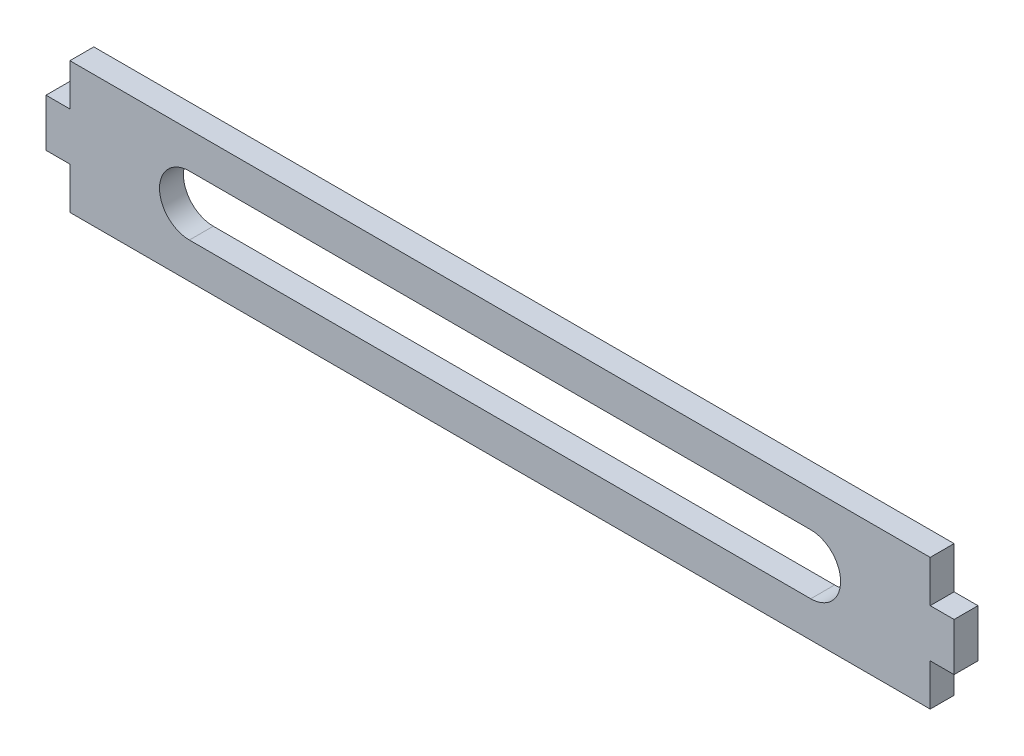
ISO-10303-21;
HEADER;
FILE_DESCRIPTION(('STEP AP214'),'2;1');
FILE_NAME('part.step','',(''),(''),'','','');
FILE_SCHEMA(('AUTOMOTIVE_DESIGN { 1 0 10303 214 1 1 1 1 }'));
ENDSEC;
DATA;
#1=APPLICATION_CONTEXT('core data for automotive mechanical design processes');
#2=APPLICATION_PROTOCOL_DEFINITION('international standard','automotive_design',2000,#1);
#3=PRODUCT_CONTEXT('',#1,'mechanical');
#4=PRODUCT('Part','Part','',(#3));
#5=PRODUCT_RELATED_PRODUCT_CATEGORY('part','',(#4));
#6=PRODUCT_DEFINITION_FORMATION('','',#4);
#7=PRODUCT_DEFINITION_CONTEXT('part definition',#1,'design');
#8=PRODUCT_DEFINITION('design','',#6,#7);
#9=PRODUCT_DEFINITION_SHAPE('','',#8);
#10=(LENGTH_UNIT() NAMED_UNIT(*) SI_UNIT(.MILLI.,.METRE.));
#11=(NAMED_UNIT(*) PLANE_ANGLE_UNIT() SI_UNIT($,.RADIAN.));
#12=(NAMED_UNIT(*) SI_UNIT($,.STERADIAN.) SOLID_ANGLE_UNIT());
#13=UNCERTAINTY_MEASURE_WITH_UNIT(LENGTH_MEASURE(1.E-05),#10,'distance_accuracy_value','');
#14=(GEOMETRIC_REPRESENTATION_CONTEXT(3) GLOBAL_UNCERTAINTY_ASSIGNED_CONTEXT((#13)) GLOBAL_UNIT_ASSIGNED_CONTEXT((#10,
#11,#12)) REPRESENTATION_CONTEXT('',''));
#15=CARTESIAN_POINT('',(0.,0.,0.));
#16=DIRECTION('',(0.,0.,1.));
#17=DIRECTION('',(1.,0.,0.));
#18=AXIS2_PLACEMENT_3D('',#15,#16,#17);
#19=CARTESIAN_POINT('',(0.,0.,3.175));
#20=DIRECTION('',(-1.,0.,0.));
#21=DIRECTION('',(0.,-1.,0.));
#22=AXIS2_PLACEMENT_3D('',#19,#20,#21);
#23=PLANE('',#22);
#24=DIRECTION('',(0.,1.,0.));
#25=VECTOR('',#24,1.);
#26=CARTESIAN_POINT('',(0.,0.,0.));
#27=LINE('',#26,#25);
#28=CARTESIAN_POINT('',(0.,0.,0.));
#29=VERTEX_POINT('',#28);
#30=CARTESIAN_POINT('',(0.,5.555107,0.));
#31=VERTEX_POINT('',#30);
#32=EDGE_CURVE('E178',#29,#31,#27,.T.);
#33=ORIENTED_EDGE('',*,*,#32,.T.);
#34=DIRECTION('',(0.,0.,-1.));
#35=VECTOR('',#34,1.);
#36=CARTESIAN_POINT('',(0.,5.555107,3.175));
#37=LINE('',#36,#35);
#38=CARTESIAN_POINT('',(0.,5.555107,3.175));
#39=VERTEX_POINT('',#38);
#40=EDGE_CURVE('E11',#39,#31,#37,.T.);
#41=ORIENTED_EDGE('',*,*,#40,.F.);
#42=DIRECTION('',(0.,1.,0.));
#43=VECTOR('',#42,1.);
#44=CARTESIAN_POINT('',(0.,0.,3.175));
#45=LINE('',#44,#43);
#46=CARTESIAN_POINT('',(0.,0.,3.175));
#47=VERTEX_POINT('',#46);
#48=EDGE_CURVE('E182',#47,#39,#45,.T.);
#49=ORIENTED_EDGE('',*,*,#48,.F.);
#50=DIRECTION('',(0.,0.,-1.));
#51=VECTOR('',#50,1.);
#52=CARTESIAN_POINT('',(0.,0.,3.175));
#53=LINE('',#52,#51);
#54=EDGE_CURVE('E208',#47,#29,#53,.T.);
#55=ORIENTED_EDGE('',*,*,#54,.T.);
#56=EDGE_LOOP('',(#33,#41,#49,#55));
#57=FACE_BOUND('',#56,.T.);
#58=ADVANCED_FACE('F33',(#57),#23,.F.);
#59=CARTESIAN_POINT('',(3.175,5.555107,3.175));
#60=DIRECTION('',(0.,1.,0.));
#61=DIRECTION('',(0.,0.,1.));
#62=AXIS2_PLACEMENT_3D('',#59,#60,#61);
#63=PLANE('',#62);
#64=DIRECTION('',(1.,0.,0.));
#65=VECTOR('',#64,1.);
#66=CARTESIAN_POINT('',(3.175,5.555107,0.));
#67=LINE('',#66,#65);
#68=CARTESIAN_POINT('',(3.175,5.555107,0.));
#69=VERTEX_POINT('',#68);
#70=EDGE_CURVE('E211',#31,#69,#67,.T.);
#71=ORIENTED_EDGE('',*,*,#70,.T.);
#72=DIRECTION('',(0.,0.,-1.));
#73=VECTOR('',#72,1.);
#74=CARTESIAN_POINT('',(3.175,5.555107,3.175));
#75=LINE('',#74,#73);
#76=CARTESIAN_POINT('',(3.175,5.555107,3.175));
#77=VERTEX_POINT('',#76);
#78=EDGE_CURVE('E40',#77,#69,#75,.T.);
#79=ORIENTED_EDGE('',*,*,#78,.F.);
#80=DIRECTION('',(1.,0.,0.));
#81=VECTOR('',#80,1.);
#82=CARTESIAN_POINT('',(3.175,5.555107,3.175));
#83=LINE('',#82,#81);
#84=EDGE_CURVE('E185',#39,#77,#83,.T.);
#85=ORIENTED_EDGE('',*,*,#84,.F.);
#86=ORIENTED_EDGE('',*,*,#40,.T.);
#87=EDGE_LOOP('',(#71,#79,#85,#86));
#88=FACE_BOUND('',#87,.T.);
#89=ADVANCED_FACE('F286',(#88),#63,.F.);
#90=CARTESIAN_POINT('',(3.175,11.905107,3.175));
#91=DIRECTION('',(-1.,0.,0.));
#92=DIRECTION('',(0.,-1.,0.));
#93=AXIS2_PLACEMENT_3D('',#90,#91,#92);
#94=PLANE('',#93);
#95=DIRECTION('',(0.,1.,0.));
#96=VECTOR('',#95,1.);
#97=CARTESIAN_POINT('',(3.175,11.905107,0.));
#98=LINE('',#97,#96);
#99=CARTESIAN_POINT('',(3.175,11.905107,0.));
#100=VERTEX_POINT('',#99);
#101=EDGE_CURVE('E213',#69,#100,#98,.T.);
#102=ORIENTED_EDGE('',*,*,#101,.T.);
#103=DIRECTION('',(0.,0.,-1.));
#104=VECTOR('',#103,1.);
#105=CARTESIAN_POINT('',(3.175,11.905107,3.175));
#106=LINE('',#105,#104);
#107=CARTESIAN_POINT('',(3.175,11.905107,3.175));
#108=VERTEX_POINT('',#107);
#109=EDGE_CURVE('E258',#108,#100,#106,.T.);
#110=ORIENTED_EDGE('',*,*,#109,.F.);
#111=DIRECTION('',(0.,1.,0.));
#112=VECTOR('',#111,1.);
#113=CARTESIAN_POINT('',(3.175,11.905107,3.175));
#114=LINE('',#113,#112);
#115=EDGE_CURVE('E188',#77,#108,#114,.T.);
#116=ORIENTED_EDGE('',*,*,#115,.F.);
#117=ORIENTED_EDGE('',*,*,#78,.T.);
#118=EDGE_LOOP('',(#102,#110,#116,#117));
#119=FACE_BOUND('',#118,.T.);
#120=ADVANCED_FACE('F265',(#119),#94,.F.);
#121=CARTESIAN_POINT('',(3.175,11.905107,3.175));
#122=DIRECTION('',(0.,-1.,0.));
#123=DIRECTION('',(1.,0.,0.));
#124=AXIS2_PLACEMENT_3D('',#121,#122,#123);
#125=PLANE('',#124);
#126=DIRECTION('',(-1.,0.,0.));
#127=VECTOR('',#126,1.);
#128=CARTESIAN_POINT('',(3.175,11.905107,0.));
#129=LINE('',#128,#127);
#130=CARTESIAN_POINT('',(0.,11.905107,0.));
#131=VERTEX_POINT('',#130);
#132=EDGE_CURVE('E215',#100,#131,#129,.T.);
#133=ORIENTED_EDGE('',*,*,#132,.T.);
#134=DIRECTION('',(0.,0.,-1.));
#135=VECTOR('',#134,1.);
#136=CARTESIAN_POINT('',(0.,11.905107,3.175));
#137=LINE('',#136,#135);
#138=CARTESIAN_POINT('',(0.,11.905107,3.175));
#139=VERTEX_POINT('',#138);
#140=EDGE_CURVE('E255',#139,#131,#137,.T.);
#141=ORIENTED_EDGE('',*,*,#140,.F.);
#142=DIRECTION('',(-1.,0.,0.));
#143=VECTOR('',#142,1.);
#144=CARTESIAN_POINT('',(3.175,11.905107,3.175));
#145=LINE('',#144,#143);
#146=EDGE_CURVE('E190',#108,#139,#145,.T.);
#147=ORIENTED_EDGE('',*,*,#146,.F.);
#148=ORIENTED_EDGE('',*,*,#109,.T.);
#149=EDGE_LOOP('',(#133,#141,#147,#148));
#150=FACE_BOUND('',#149,.T.);
#151=ADVANCED_FACE('F274',(#150),#125,.F.);
#152=CARTESIAN_POINT('',(0.,11.905107,3.175));
#153=DIRECTION('',(-1.,0.,0.));
#154=DIRECTION('',(0.,-1.,0.));
#155=AXIS2_PLACEMENT_3D('',#152,#153,#154);
#156=PLANE('',#155);
#157=DIRECTION('',(0.,1.,0.));
#158=VECTOR('',#157,1.);
#159=CARTESIAN_POINT('',(0.,11.905107,0.));
#160=LINE('',#159,#158);
#161=CARTESIAN_POINT('',(0.,17.460214,0.));
#162=VERTEX_POINT('',#161);
#163=EDGE_CURVE('E217',#131,#162,#160,.T.);
#164=ORIENTED_EDGE('',*,*,#163,.T.);
#165=DIRECTION('',(0.,0.,-1.));
#166=VECTOR('',#165,1.);
#167=CARTESIAN_POINT('',(0.,17.460214,3.175));
#168=LINE('',#167,#166);
#169=CARTESIAN_POINT('',(0.,17.460214,3.175));
#170=VERTEX_POINT('',#169);
#171=EDGE_CURVE('E252',#170,#162,#168,.T.);
#172=ORIENTED_EDGE('',*,*,#171,.F.);
#173=DIRECTION('',(0.,1.,0.));
#174=VECTOR('',#173,1.);
#175=CARTESIAN_POINT('',(0.,11.905107,3.175));
#176=LINE('',#175,#174);
#177=EDGE_CURVE('E192',#139,#170,#176,.T.);
#178=ORIENTED_EDGE('',*,*,#177,.F.);
#179=ORIENTED_EDGE('',*,*,#140,.T.);
#180=EDGE_LOOP('',(#164,#172,#178,#179));
#181=FACE_BOUND('',#180,.T.);
#182=ADVANCED_FACE('F278',(#181),#156,.F.);
#183=CARTESIAN_POINT('',(0.,17.460214,3.175));
#184=DIRECTION('',(0.,-1.,0.));
#185=DIRECTION('',(1.,0.,0.));
#186=AXIS2_PLACEMENT_3D('',#183,#184,#185);
#187=PLANE('',#186);
#188=DIRECTION('',(-1.,0.,0.));
#189=VECTOR('',#188,1.);
#190=CARTESIAN_POINT('',(0.,17.460214,0.));
#191=LINE('',#190,#189);
#192=CARTESIAN_POINT('',(-114.3,17.460214,0.));
#193=VERTEX_POINT('',#192);
#194=EDGE_CURVE('E219',#162,#193,#191,.T.);
#195=ORIENTED_EDGE('',*,*,#194,.T.);
#196=DIRECTION('',(0.,0.,-1.));
#197=VECTOR('',#196,1.);
#198=CARTESIAN_POINT('',(-114.3,17.460214,3.175));
#199=LINE('',#198,#197);
#200=CARTESIAN_POINT('',(-114.3,17.460214,3.175));
#201=VERTEX_POINT('',#200);
#202=EDGE_CURVE('E249',#201,#193,#199,.T.);
#203=ORIENTED_EDGE('',*,*,#202,.F.);
#204=DIRECTION('',(-1.,0.,0.));
#205=VECTOR('',#204,1.);
#206=CARTESIAN_POINT('',(0.,17.460214,3.175));
#207=LINE('',#206,#205);
#208=EDGE_CURVE('E194',#170,#201,#207,.T.);
#209=ORIENTED_EDGE('',*,*,#208,.F.);
#210=ORIENTED_EDGE('',*,*,#171,.T.);
#211=EDGE_LOOP('',(#195,#203,#209,#210));
#212=FACE_BOUND('',#211,.T.);
#213=ADVANCED_FACE('F319',(#212),#187,.F.);
#214=CARTESIAN_POINT('',(-114.3,11.905107,3.175));
#215=DIRECTION('',(1.,0.,0.));
#216=DIRECTION('',(0.,0.,-1.));
#217=AXIS2_PLACEMENT_3D('',#214,#215,#216);
#218=PLANE('',#217);
#219=DIRECTION('',(0.,-1.,0.));
#220=VECTOR('',#219,1.);
#221=CARTESIAN_POINT('',(-114.3,11.905107,0.));
#222=LINE('',#221,#220);
#223=CARTESIAN_POINT('',(-114.3,11.905107,0.));
#224=VERTEX_POINT('',#223);
#225=EDGE_CURVE('E221',#193,#224,#222,.T.);
#226=ORIENTED_EDGE('',*,*,#225,.T.);
#227=DIRECTION('',(0.,0.,-1.));
#228=VECTOR('',#227,1.);
#229=CARTESIAN_POINT('',(-114.3,11.905107,3.175));
#230=LINE('',#229,#228);
#231=CARTESIAN_POINT('',(-114.3,11.905107,3.175));
#232=VERTEX_POINT('',#231);
#233=EDGE_CURVE('E246',#232,#224,#230,.T.);
#234=ORIENTED_EDGE('',*,*,#233,.F.);
#235=DIRECTION('',(0.,-1.,0.));
#236=VECTOR('',#235,1.);
#237=CARTESIAN_POINT('',(-114.3,11.905107,3.175));
#238=LINE('',#237,#236);
#239=EDGE_CURVE('E196',#201,#232,#238,.T.);
#240=ORIENTED_EDGE('',*,*,#239,.F.);
#241=ORIENTED_EDGE('',*,*,#202,.T.);
#242=EDGE_LOOP('',(#226,#234,#240,#241));
#243=FACE_BOUND('',#242,.T.);
#244=ADVANCED_FACE('F317',(#243),#218,.F.);
#245=CARTESIAN_POINT('',(-117.475,11.905107,3.175));
#246=DIRECTION('',(0.,-1.,0.));
#247=DIRECTION('',(1.,0.,0.));
#248=AXIS2_PLACEMENT_3D('',#245,#246,#247);
#249=PLANE('',#248);
#250=DIRECTION('',(-1.,0.,0.));
#251=VECTOR('',#250,1.);
#252=CARTESIAN_POINT('',(-117.475,11.905107,0.));
#253=LINE('',#252,#251);
#254=CARTESIAN_POINT('',(-117.475,11.905107,0.));
#255=VERTEX_POINT('',#254);
#256=EDGE_CURVE('E223',#224,#255,#253,.T.);
#257=ORIENTED_EDGE('',*,*,#256,.T.);
#258=DIRECTION('',(0.,0.,-1.));
#259=VECTOR('',#258,1.);
#260=CARTESIAN_POINT('',(-117.475,11.905107,3.175));
#261=LINE('',#260,#259);
#262=CARTESIAN_POINT('',(-117.475,11.905107,3.175));
#263=VERTEX_POINT('',#262);
#264=EDGE_CURVE('E243',#263,#255,#261,.T.);
#265=ORIENTED_EDGE('',*,*,#264,.F.);
#266=DIRECTION('',(-1.,0.,0.));
#267=VECTOR('',#266,1.);
#268=CARTESIAN_POINT('',(-117.475,11.905107,3.175));
#269=LINE('',#268,#267);
#270=EDGE_CURVE('E198',#232,#263,#269,.T.);
#271=ORIENTED_EDGE('',*,*,#270,.F.);
#272=ORIENTED_EDGE('',*,*,#233,.T.);
#273=EDGE_LOOP('',(#257,#265,#271,#272));
#274=FACE_BOUND('',#273,.T.);
#275=ADVANCED_FACE('F313',(#274),#249,.F.);
#276=CARTESIAN_POINT('',(-117.475,11.905107,3.175));
#277=DIRECTION('',(1.,0.,0.));
#278=DIRECTION('',(0.,1.,0.));
#279=AXIS2_PLACEMENT_3D('',#276,#277,#278);
#280=PLANE('',#279);
#281=DIRECTION('',(0.,-1.,0.));
#282=VECTOR('',#281,1.);
#283=CARTESIAN_POINT('',(-117.475,11.905107,0.));
#284=LINE('',#283,#282);
#285=CARTESIAN_POINT('',(-117.475,5.555107,0.));
#286=VERTEX_POINT('',#285);
#287=EDGE_CURVE('E225',#255,#286,#284,.T.);
#288=ORIENTED_EDGE('',*,*,#287,.T.);
#289=DIRECTION('',(0.,0.,-1.));
#290=VECTOR('',#289,1.);
#291=CARTESIAN_POINT('',(-117.475,5.555107,3.175));
#292=LINE('',#291,#290);
#293=CARTESIAN_POINT('',(-117.475,5.555107,3.175));
#294=VERTEX_POINT('',#293);
#295=EDGE_CURVE('E240',#294,#286,#292,.T.);
#296=ORIENTED_EDGE('',*,*,#295,.F.);
#297=DIRECTION('',(0.,-1.,0.));
#298=VECTOR('',#297,1.);
#299=CARTESIAN_POINT('',(-117.475,11.905107,3.175));
#300=LINE('',#299,#298);
#301=EDGE_CURVE('E200',#263,#294,#300,.T.);
#302=ORIENTED_EDGE('',*,*,#301,.F.);
#303=ORIENTED_EDGE('',*,*,#264,.T.);
#304=EDGE_LOOP('',(#288,#296,#302,#303));
#305=FACE_BOUND('',#304,.T.);
#306=ADVANCED_FACE('F308',(#305),#280,.F.);
#307=CARTESIAN_POINT('',(-117.475,5.555107,3.175));
#308=DIRECTION('',(0.,1.,0.));
#309=DIRECTION('',(0.,0.,1.));
#310=AXIS2_PLACEMENT_3D('',#307,#308,#309);
#311=PLANE('',#310);
#312=DIRECTION('',(1.,0.,0.));
#313=VECTOR('',#312,1.);
#314=CARTESIAN_POINT('',(-117.475,5.555107,0.));
#315=LINE('',#314,#313);
#316=CARTESIAN_POINT('',(-114.3,5.555107,0.));
#317=VERTEX_POINT('',#316);
#318=EDGE_CURVE('E227',#286,#317,#315,.T.);
#319=ORIENTED_EDGE('',*,*,#318,.T.);
#320=DIRECTION('',(0.,0.,-1.));
#321=VECTOR('',#320,1.);
#322=CARTESIAN_POINT('',(-114.3,5.555107,3.175));
#323=LINE('',#322,#321);
#324=CARTESIAN_POINT('',(-114.3,5.555107,3.175));
#325=VERTEX_POINT('',#324);
#326=EDGE_CURVE('E237',#325,#317,#323,.T.);
#327=ORIENTED_EDGE('',*,*,#326,.F.);
#328=DIRECTION('',(1.,0.,0.));
#329=VECTOR('',#328,1.);
#330=CARTESIAN_POINT('',(-117.475,5.555107,3.175));
#331=LINE('',#330,#329);
#332=EDGE_CURVE('E202',#294,#325,#331,.T.);
#333=ORIENTED_EDGE('',*,*,#332,.F.);
#334=ORIENTED_EDGE('',*,*,#295,.T.);
#335=EDGE_LOOP('',(#319,#327,#333,#334));
#336=FACE_BOUND('',#335,.T.);
#337=ADVANCED_FACE('F302',(#336),#311,.F.);
#338=CARTESIAN_POINT('',(-114.3,0.,3.175));
#339=DIRECTION('',(1.,0.,0.));
#340=DIRECTION('',(0.,0.,-1.));
#341=AXIS2_PLACEMENT_3D('',#338,#339,#340);
#342=PLANE('',#341);
#343=DIRECTION('',(0.,-1.,0.));
#344=VECTOR('',#343,1.);
#345=CARTESIAN_POINT('',(-114.3,0.,0.));
#346=LINE('',#345,#344);
#347=CARTESIAN_POINT('',(-114.3,0.,0.));
#348=VERTEX_POINT('',#347);
#349=EDGE_CURVE('E229',#317,#348,#346,.T.);
#350=ORIENTED_EDGE('',*,*,#349,.T.);
#351=DIRECTION('',(0.,0.,-1.));
#352=VECTOR('',#351,1.);
#353=CARTESIAN_POINT('',(-114.3,0.,3.175));
#354=LINE('',#353,#352);
#355=CARTESIAN_POINT('',(-114.3,0.,3.175));
#356=VERTEX_POINT('',#355);
#357=EDGE_CURVE('E234',#356,#348,#354,.T.);
#358=ORIENTED_EDGE('',*,*,#357,.F.);
#359=DIRECTION('',(0.,-1.,0.));
#360=VECTOR('',#359,1.);
#361=CARTESIAN_POINT('',(-114.3,0.,3.175));
#362=LINE('',#361,#360);
#363=EDGE_CURVE('E204',#325,#356,#362,.T.);
#364=ORIENTED_EDGE('',*,*,#363,.F.);
#365=ORIENTED_EDGE('',*,*,#326,.T.);
#366=EDGE_LOOP('',(#350,#358,#364,#365));
#367=FACE_BOUND('',#366,.T.);
#368=ADVANCED_FACE('F298',(#367),#342,.F.);
#369=CARTESIAN_POINT('',(0.,0.,3.175));
#370=DIRECTION('',(0.,1.,0.));
#371=DIRECTION('',(0.,0.,1.));
#372=AXIS2_PLACEMENT_3D('',#369,#370,#371);
#373=PLANE('',#372);
#374=DIRECTION('',(1.,0.,0.));
#375=VECTOR('',#374,1.);
#376=CARTESIAN_POINT('',(0.,0.,0.));
#377=LINE('',#376,#375);
#378=EDGE_CURVE('E186',#348,#29,#377,.T.);
#379=ORIENTED_EDGE('',*,*,#378,.T.);
#380=ORIENTED_EDGE('',*,*,#54,.F.);
#381=DIRECTION('',(1.,0.,0.));
#382=VECTOR('',#381,1.);
#383=CARTESIAN_POINT('',(0.,0.,3.175));
#384=LINE('',#383,#382);
#385=EDGE_CURVE('E206',#356,#47,#384,.T.);
#386=ORIENTED_EDGE('',*,*,#385,.F.);
#387=ORIENTED_EDGE('',*,*,#357,.T.);
#388=EDGE_LOOP('',(#379,#380,#386,#387));
#389=FACE_BOUND('',#388,.T.);
#390=ADVANCED_FACE('F293',(#389),#373,.F.);
#391=CARTESIAN_POINT('',(0.,0.,3.175));
#392=DIRECTION('',(0.,0.,1.));
#393=DIRECTION('',(1.,0.,0.));
#394=AXIS2_PLACEMENT_3D('',#391,#392,#393);
#395=PLANE('',#394);
#396=CARTESIAN_POINT('',(-15.875,8.73010699999999,3.175));
#397=DIRECTION('',(0.,0.,1.));
#398=DIRECTION('',(1.,0.,0.));
#399=AXIS2_PLACEMENT_3D('',#396,#397,#398);
#400=CIRCLE('',#399,3.96875);
#401=CARTESIAN_POINT('',(-15.875,4.761357,3.175));
#402=VERTEX_POINT('',#401);
#403=CARTESIAN_POINT('',(-15.875,12.698857,3.175));
#404=VERTEX_POINT('',#403);
#405=EDGE_CURVE('E47',#402,#404,#400,.T.);
#406=ORIENTED_EDGE('',*,*,#405,.F.);
#407=DIRECTION('',(1.,0.,0.));
#408=VECTOR('',#407,1.);
#409=CARTESIAN_POINT('',(-15.875,4.761357,3.175));
#410=LINE('',#409,#408);
#411=CARTESIAN_POINT('',(-98.425,4.76135699999999,3.175));
#412=VERTEX_POINT('',#411);
#413=EDGE_CURVE('E163',#412,#402,#410,.T.);
#414=ORIENTED_EDGE('',*,*,#413,.F.);
#415=CARTESIAN_POINT('',(-98.425,8.73010699999999,3.175));
#416=DIRECTION('',(0.,0.,1.));
#417=DIRECTION('',(1.,0.,0.));
#418=AXIS2_PLACEMENT_3D('',#415,#416,#417);
#419=CIRCLE('',#418,3.96875);
#420=CARTESIAN_POINT('',(-98.425,12.698857,3.175));
#421=VERTEX_POINT('',#420);
#422=EDGE_CURVE('E166',#421,#412,#419,.T.);
#423=ORIENTED_EDGE('',*,*,#422,.F.);
#424=DIRECTION('',(-1.,0.,0.));
#425=VECTOR('',#424,1.);
#426=CARTESIAN_POINT('',(-15.875,12.698857,3.175));
#427=LINE('',#426,#425);
#428=EDGE_CURVE('E172',#404,#421,#427,.T.);
#429=ORIENTED_EDGE('',*,*,#428,.F.);
#430=EDGE_LOOP('',(#406,#414,#423,#429));
#431=FACE_BOUND('',#430,.T.);
#432=ORIENTED_EDGE('',*,*,#48,.T.);
#433=ORIENTED_EDGE('',*,*,#84,.T.);
#434=ORIENTED_EDGE('',*,*,#115,.T.);
#435=ORIENTED_EDGE('',*,*,#146,.T.);
#436=ORIENTED_EDGE('',*,*,#177,.T.);
#437=ORIENTED_EDGE('',*,*,#208,.T.);
#438=ORIENTED_EDGE('',*,*,#239,.T.);
#439=ORIENTED_EDGE('',*,*,#270,.T.);
#440=ORIENTED_EDGE('',*,*,#301,.T.);
#441=ORIENTED_EDGE('',*,*,#332,.T.);
#442=ORIENTED_EDGE('',*,*,#363,.T.);
#443=ORIENTED_EDGE('',*,*,#385,.T.);
#444=EDGE_LOOP('',(#432,#433,#434,#435,#436,#437,#438,#439,#440,#441,#442,#443));
#445=FACE_BOUND('',#444,.T.);
#446=ADVANCED_FACE('F282',(#431,#445),#395,.T.);
#447=CARTESIAN_POINT('',(0.,0.,0.));
#448=DIRECTION('',(0.,0.,1.));
#449=DIRECTION('',(1.,0.,0.));
#450=AXIS2_PLACEMENT_3D('',#447,#448,#449);
#451=PLANE('',#450);
#452=DIRECTION('',(1.,0.,0.));
#453=VECTOR('',#452,1.);
#454=CARTESIAN_POINT('',(-15.875,4.761357,0.));
#455=LINE('',#454,#453);
#456=CARTESIAN_POINT('',(-98.425,4.76135699999999,0.));
#457=VERTEX_POINT('',#456);
#458=CARTESIAN_POINT('',(-15.875,4.761357,0.));
#459=VERTEX_POINT('',#458);
#460=EDGE_CURVE('E153',#457,#459,#455,.T.);
#461=ORIENTED_EDGE('',*,*,#460,.T.);
#462=CARTESIAN_POINT('',(-15.875,8.73010699999999,0.));
#463=DIRECTION('',(0.,0.,1.));
#464=DIRECTION('',(1.,0.,0.));
#465=AXIS2_PLACEMENT_3D('',#462,#463,#464);
#466=CIRCLE('',#465,3.96875);
#467=CARTESIAN_POINT('',(-15.875,12.698857,0.));
#468=VERTEX_POINT('',#467);
#469=EDGE_CURVE('E147',#459,#468,#466,.T.);
#470=ORIENTED_EDGE('',*,*,#469,.T.);
#471=DIRECTION('',(-1.,0.,0.));
#472=VECTOR('',#471,1.);
#473=CARTESIAN_POINT('',(-15.875,12.698857,0.));
#474=LINE('',#473,#472);
#475=CARTESIAN_POINT('',(-98.425,12.698857,0.));
#476=VERTEX_POINT('',#475);
#477=EDGE_CURVE('E156',#468,#476,#474,.T.);
#478=ORIENTED_EDGE('',*,*,#477,.T.);
#479=CARTESIAN_POINT('',(-98.425,8.73010699999999,0.));
#480=DIRECTION('',(0.,0.,1.));
#481=DIRECTION('',(1.,0.,0.));
#482=AXIS2_PLACEMENT_3D('',#479,#480,#481);
#483=CIRCLE('',#482,3.96875);
#484=EDGE_CURVE('E55',#476,#457,#483,.T.);
#485=ORIENTED_EDGE('',*,*,#484,.T.);
#486=EDGE_LOOP('',(#461,#470,#478,#485));
#487=FACE_BOUND('',#486,.T.);
#488=ORIENTED_EDGE('',*,*,#32,.F.);
#489=ORIENTED_EDGE('',*,*,#378,.F.);
#490=ORIENTED_EDGE('',*,*,#349,.F.);
#491=ORIENTED_EDGE('',*,*,#318,.F.);
#492=ORIENTED_EDGE('',*,*,#287,.F.);
#493=ORIENTED_EDGE('',*,*,#256,.F.);
#494=ORIENTED_EDGE('',*,*,#225,.F.);
#495=ORIENTED_EDGE('',*,*,#194,.F.);
#496=ORIENTED_EDGE('',*,*,#163,.F.);
#497=ORIENTED_EDGE('',*,*,#132,.F.);
#498=ORIENTED_EDGE('',*,*,#101,.F.);
#499=ORIENTED_EDGE('',*,*,#70,.F.);
#500=EDGE_LOOP('',(#488,#489,#490,#491,#492,#493,#494,#495,#496,#497,#498,#499));
#501=FACE_BOUND('',#500,.T.);
#502=ADVANCED_FACE('F160',(#487,#501),#451,.F.);
#503=CARTESIAN_POINT('',(-15.875,8.73010699999999,0.));
#504=DIRECTION('',(0.,0.,1.));
#505=DIRECTION('',(1.,0.,0.));
#506=AXIS2_PLACEMENT_3D('',#503,#504,#505);
#507=CYLINDRICAL_SURFACE('',#506,3.96875);
#508=ORIENTED_EDGE('',*,*,#405,.T.);
#509=DIRECTION('',(0.,0.,1.));
#510=VECTOR('',#509,1.);
#511=CARTESIAN_POINT('',(-15.875,12.698857,0.));
#512=LINE('',#511,#510);
#513=EDGE_CURVE('E143',#468,#404,#512,.T.);
#514=ORIENTED_EDGE('',*,*,#513,.F.);
#515=ORIENTED_EDGE('',*,*,#469,.F.);
#516=DIRECTION('',(0.,0.,1.));
#517=VECTOR('',#516,1.);
#518=CARTESIAN_POINT('',(-15.875,4.761357,0.));
#519=LINE('',#518,#517);
#520=EDGE_CURVE('E176',#459,#402,#519,.T.);
#521=ORIENTED_EDGE('',*,*,#520,.T.);
#522=EDGE_LOOP('',(#508,#514,#515,#521));
#523=FACE_BOUND('',#522,.T.);
#524=ADVANCED_FACE('F145',(#523),#507,.F.);
#525=CARTESIAN_POINT('',(-15.875,4.761357,0.));
#526=DIRECTION('',(0.,-1.,0.));
#527=DIRECTION('',(1.,0.,0.));
#528=AXIS2_PLACEMENT_3D('',#525,#526,#527);
#529=PLANE('',#528);
#530=ORIENTED_EDGE('',*,*,#413,.T.);
#531=ORIENTED_EDGE('',*,*,#520,.F.);
#532=ORIENTED_EDGE('',*,*,#460,.F.);
#533=DIRECTION('',(0.,0.,1.));
#534=VECTOR('',#533,1.);
#535=CARTESIAN_POINT('',(-98.425,4.76135699999999,0.));
#536=LINE('',#535,#534);
#537=EDGE_CURVE('E179',#457,#412,#536,.T.);
#538=ORIENTED_EDGE('',*,*,#537,.T.);
#539=EDGE_LOOP('',(#530,#531,#532,#538));
#540=FACE_BOUND('',#539,.T.);
#541=ADVANCED_FACE('F418',(#540),#529,.F.);
#542=CARTESIAN_POINT('',(-98.425,8.73010699999999,0.));
#543=DIRECTION('',(0.,0.,1.));
#544=DIRECTION('',(1.,0.,0.));
#545=AXIS2_PLACEMENT_3D('',#542,#543,#544);
#546=CYLINDRICAL_SURFACE('',#545,3.96875);
#547=ORIENTED_EDGE('',*,*,#422,.T.);
#548=ORIENTED_EDGE('',*,*,#537,.F.);
#549=ORIENTED_EDGE('',*,*,#484,.F.);
#550=DIRECTION('',(0.,0.,1.));
#551=VECTOR('',#550,1.);
#552=CARTESIAN_POINT('',(-98.425,12.698857,0.));
#553=LINE('',#552,#551);
#554=EDGE_CURVE('E152',#476,#421,#553,.T.);
#555=ORIENTED_EDGE('',*,*,#554,.T.);
#556=EDGE_LOOP('',(#547,#548,#549,#555));
#557=FACE_BOUND('',#556,.T.);
#558=ADVANCED_FACE('F427',(#557),#546,.F.);
#559=CARTESIAN_POINT('',(-15.875,12.698857,0.));
#560=DIRECTION('',(0.,1.,0.));
#561=DIRECTION('',(-1.,0.,0.));
#562=AXIS2_PLACEMENT_3D('',#559,#560,#561);
#563=PLANE('',#562);
#564=ORIENTED_EDGE('',*,*,#428,.T.);
#565=ORIENTED_EDGE('',*,*,#554,.F.);
#566=ORIENTED_EDGE('',*,*,#477,.F.);
#567=ORIENTED_EDGE('',*,*,#513,.T.);
#568=EDGE_LOOP('',(#564,#565,#566,#567));
#569=FACE_BOUND('',#568,.T.);
#570=ADVANCED_FACE('F157',(#569),#563,.F.);
#571=CLOSED_SHELL('',(#58,#89,#120,#151,#182,#213,#244,#275,#306,#337,#368,#390,#446,#502,#524,
#541,#558,#570));
#572=MANIFOLD_SOLID_BREP('B2',#571);
#573=ADVANCED_BREP_SHAPE_REPRESENTATION('',(#18,#572),#14);
#574=SHAPE_DEFINITION_REPRESENTATION(#9,#573);
ENDSEC;
END-ISO-10303-21;
